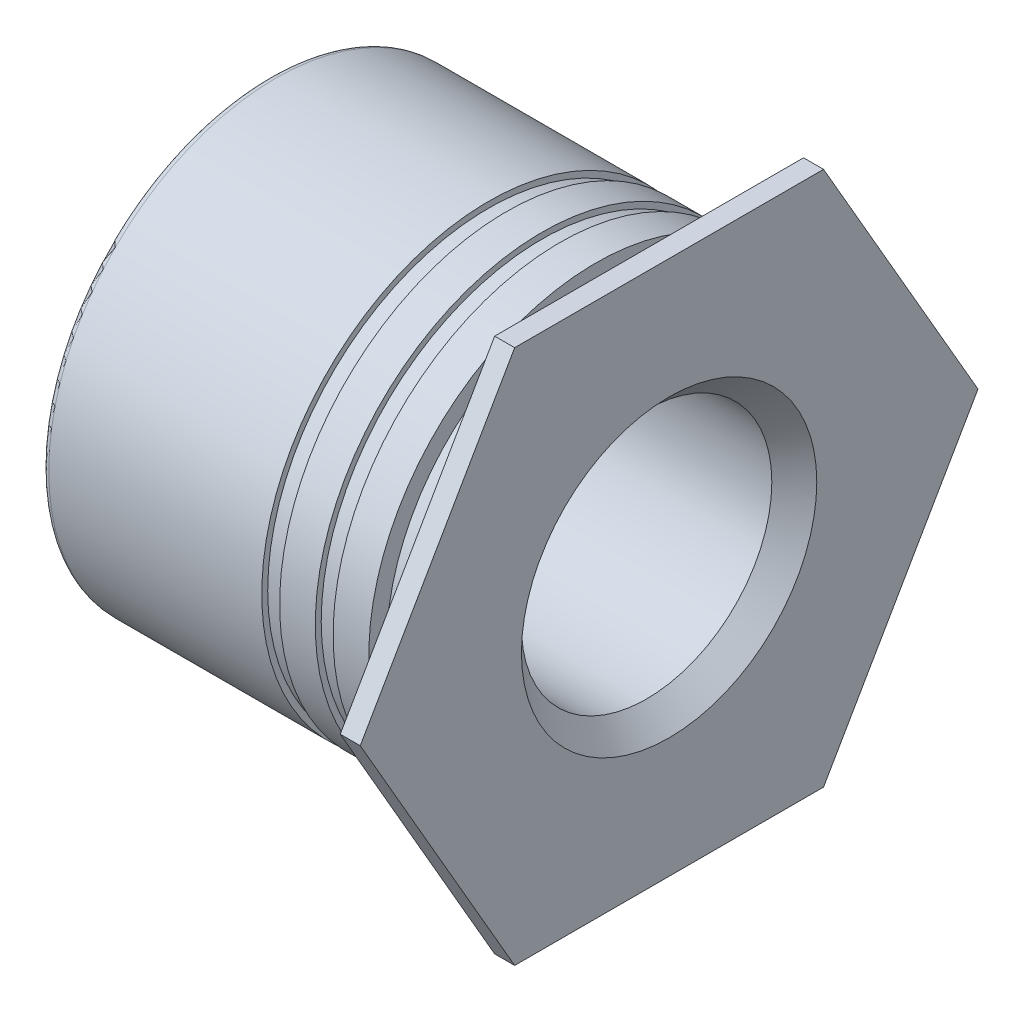
ISO-10303-21;
HEADER;
FILE_DESCRIPTION(('STEP AP214'),'2;1');
FILE_NAME('part.step','',(''),(''),'','','');
FILE_SCHEMA(('AUTOMOTIVE_DESIGN { 1 0 10303 214 1 1 1 1 }'));
ENDSEC;
DATA;
#1=APPLICATION_CONTEXT('core data for automotive mechanical design processes');
#2=APPLICATION_PROTOCOL_DEFINITION('international standard','automotive_design',2000,#1);
#3=PRODUCT_CONTEXT('',#1,'mechanical');
#4=PRODUCT('Part','Part','',(#3));
#5=PRODUCT_RELATED_PRODUCT_CATEGORY('part','',(#4));
#6=PRODUCT_DEFINITION_FORMATION('','',#4);
#7=PRODUCT_DEFINITION_CONTEXT('part definition',#1,'design');
#8=PRODUCT_DEFINITION('design','',#6,#7);
#9=PRODUCT_DEFINITION_SHAPE('','',#8);
#10=(LENGTH_UNIT() NAMED_UNIT(*) SI_UNIT(.MILLI.,.METRE.));
#11=(NAMED_UNIT(*) PLANE_ANGLE_UNIT() SI_UNIT($,.RADIAN.));
#12=(NAMED_UNIT(*) SI_UNIT($,.STERADIAN.) SOLID_ANGLE_UNIT());
#13=UNCERTAINTY_MEASURE_WITH_UNIT(LENGTH_MEASURE(1.E-05),#10,'distance_accuracy_value','');
#14=(GEOMETRIC_REPRESENTATION_CONTEXT(3) GLOBAL_UNCERTAINTY_ASSIGNED_CONTEXT((#13)) GLOBAL_UNIT_ASSIGNED_CONTEXT((#10,
#11,#12)) REPRESENTATION_CONTEXT('',''));
#15=CARTESIAN_POINT('',(0.,0.,0.));
#16=DIRECTION('',(0.,0.,1.));
#17=DIRECTION('',(1.,0.,0.));
#18=AXIS2_PLACEMENT_3D('',#15,#16,#17);
#19=CARTESIAN_POINT('',(-1.27,0.,0.));
#20=DIRECTION('',(1.,0.,0.));
#21=DIRECTION('',(0.,0.,-1.));
#22=AXIS2_PLACEMENT_3D('',#19,#20,#21);
#23=CYLINDRICAL_SURFACE('',#22,2.6218444444444);
#24=CARTESIAN_POINT('',(-1.27,0.,0.));
#25=DIRECTION('',(1.,0.,0.));
#26=DIRECTION('',(0.,0.,-1.));
#27=AXIS2_PLACEMENT_3D('',#24,#25,#26);
#28=CIRCLE('',#27,2.6218444444444);
#29=CARTESIAN_POINT('',(-1.27,0.,-2.6218444444444));
#30=VERTEX_POINT('',#29);
#31=EDGE_CURVE('E184',#30,#30,#28,.F.);
#32=ORIENTED_EDGE('',*,*,#31,.F.);
#33=EDGE_LOOP('',(#32));
#34=FACE_BOUND('',#33,.T.);
#35=CARTESIAN_POINT('',(-1.0583333333333,0.,0.));
#36=DIRECTION('',(1.,0.,0.));
#37=DIRECTION('',(0.,0.,-1.));
#38=AXIS2_PLACEMENT_3D('',#35,#36,#37);
#39=CIRCLE('',#38,2.6218444444444);
#40=CARTESIAN_POINT('',(-1.0583333333333,0.,-2.6218444444444));
#41=VERTEX_POINT('',#40);
#42=EDGE_CURVE('E21',#41,#41,#39,.T.);
#43=ORIENTED_EDGE('',*,*,#42,.F.);
#44=EDGE_LOOP('',(#43));
#45=FACE_BOUND('',#44,.T.);
#46=ADVANCED_FACE('F17',(#34,#45),#23,.T.);
#47=CARTESIAN_POINT('',(-1.0583333333333,-2.6924,-2.6924));
#48=DIRECTION('',(-1.,0.,0.));
#49=DIRECTION('',(0.,0.,1.));
#50=AXIS2_PLACEMENT_3D('',#47,#48,#49);
#51=PLANE('',#50);
#52=ORIENTED_EDGE('',*,*,#42,.T.);
#53=EDGE_LOOP('',(#52));
#54=FACE_BOUND('',#53,.T.);
#55=CARTESIAN_POINT('',(-1.0583333333333,0.,0.));
#56=DIRECTION('',(1.,0.,0.));
#57=DIRECTION('',(0.,0.,-1.));
#58=AXIS2_PLACEMENT_3D('',#55,#56,#57);
#59=CIRCLE('',#58,2.6924);
#60=CARTESIAN_POINT('',(-1.0583333333333,0.,-2.6924));
#61=VERTEX_POINT('',#60);
#62=EDGE_CURVE('E182',#61,#61,#59,.T.);
#63=ORIENTED_EDGE('',*,*,#62,.F.);
#64=EDGE_LOOP('',(#63));
#65=FACE_BOUND('',#64,.T.);
#66=ADVANCED_FACE('F191',(#54,#65),#51,.T.);
#67=CARTESIAN_POINT('',(-1.27,-2.6924,2.746248));
#68=DIRECTION('',(1.,0.,0.));
#69=DIRECTION('',(0.,0.,-1.));
#70=AXIS2_PLACEMENT_3D('',#67,#68,#69);
#71=PLANE('',#70);
#72=CARTESIAN_POINT('',(-1.27,0.,0.));
#73=DIRECTION('',(1.,0.,0.));
#74=DIRECTION('',(0.,0.,-1.));
#75=AXIS2_PLACEMENT_3D('',#72,#73,#74);
#76=CIRCLE('',#75,2.6924);
#77=CARTESIAN_POINT('',(-1.27,0.,-2.6924));
#78=VERTEX_POINT('',#77);
#79=EDGE_CURVE('E179',#78,#78,#76,.F.);
#80=ORIENTED_EDGE('',*,*,#79,.F.);
#81=EDGE_LOOP('',(#80));
#82=FACE_BOUND('',#81,.T.);
#83=ORIENTED_EDGE('',*,*,#31,.T.);
#84=EDGE_LOOP('',(#83));
#85=FACE_BOUND('',#84,.T.);
#86=ADVANCED_FACE('F202',(#82,#85),#71,.T.);
#87=CARTESIAN_POINT('',(-1.0583333333333,0.,0.));
#88=DIRECTION('',(1.,0.,0.));
#89=DIRECTION('',(0.,0.,-1.));
#90=AXIS2_PLACEMENT_3D('',#87,#88,#89);
#91=CYLINDRICAL_SURFACE('',#90,2.6924);
#92=CARTESIAN_POINT('',(-0.635,0.,0.));
#93=DIRECTION('',(1.,0.,0.));
#94=DIRECTION('',(0.,0.,-1.));
#95=AXIS2_PLACEMENT_3D('',#92,#93,#94);
#96=CIRCLE('',#95,2.6924);
#97=CARTESIAN_POINT('',(-0.635,0.,-2.6924));
#98=VERTEX_POINT('',#97);
#99=EDGE_CURVE('E176',#98,#98,#96,.T.);
#100=ORIENTED_EDGE('',*,*,#99,.F.);
#101=EDGE_LOOP('',(#100));
#102=FACE_BOUND('',#101,.T.);
#103=ORIENTED_EDGE('',*,*,#62,.T.);
#104=EDGE_LOOP('',(#103));
#105=FACE_BOUND('',#104,.T.);
#106=ADVANCED_FACE('F284',(#102,#105),#91,.T.);
#107=CARTESIAN_POINT('',(-1.6933333333333,0.,0.));
#108=DIRECTION('',(1.,0.,0.));
#109=DIRECTION('',(0.,0.,-1.));
#110=AXIS2_PLACEMENT_3D('',#107,#108,#109);
#111=CYLINDRICAL_SURFACE('',#110,2.6924);
#112=ORIENTED_EDGE('',*,*,#79,.T.);
#113=EDGE_LOOP('',(#112));
#114=FACE_BOUND('',#113,.T.);
#115=CARTESIAN_POINT('',(-1.6933333333333,0.,0.));
#116=DIRECTION('',(1.,0.,0.));
#117=DIRECTION('',(0.,0.,-1.));
#118=AXIS2_PLACEMENT_3D('',#115,#116,#117);
#119=CIRCLE('',#118,2.6924);
#120=CARTESIAN_POINT('',(-1.6933333333333,0.,-2.6924));
#121=VERTEX_POINT('',#120);
#122=EDGE_CURVE('E173',#121,#121,#119,.F.);
#123=ORIENTED_EDGE('',*,*,#122,.F.);
#124=EDGE_LOOP('',(#123));
#125=FACE_BOUND('',#124,.T.);
#126=ADVANCED_FACE('F280',(#114,#125),#111,.T.);
#127=CARTESIAN_POINT('',(-0.635,-2.6924,2.746248));
#128=DIRECTION('',(1.,0.,0.));
#129=DIRECTION('',(0.,0.,-1.));
#130=AXIS2_PLACEMENT_3D('',#127,#128,#129);
#131=PLANE('',#130);
#132=ORIENTED_EDGE('',*,*,#99,.T.);
#133=EDGE_LOOP('',(#132));
#134=FACE_BOUND('',#133,.T.);
#135=CARTESIAN_POINT('',(-0.635,0.,0.));
#136=DIRECTION('',(1.,0.,0.));
#137=DIRECTION('',(0.,0.,-1.));
#138=AXIS2_PLACEMENT_3D('',#135,#136,#137);
#139=CIRCLE('',#138,2.4807333333333);
#140=CARTESIAN_POINT('',(-0.635,0.,-2.4807333333333));
#141=VERTEX_POINT('',#140);
#142=EDGE_CURVE('E170',#141,#141,#139,.T.);
#143=ORIENTED_EDGE('',*,*,#142,.F.);
#144=EDGE_LOOP('',(#143));
#145=FACE_BOUND('',#144,.T.);
#146=ADVANCED_FACE('F276',(#134,#145),#131,.T.);
#147=CARTESIAN_POINT('',(-1.6933333333333,-2.6924,-2.6924));
#148=DIRECTION('',(-1.,0.,0.));
#149=DIRECTION('',(0.,0.,1.));
#150=AXIS2_PLACEMENT_3D('',#147,#148,#149);
#151=PLANE('',#150);
#152=CARTESIAN_POINT('',(-1.6933333333333,0.,0.));
#153=DIRECTION('',(1.,0.,0.));
#154=DIRECTION('',(0.,0.,-1.));
#155=AXIS2_PLACEMENT_3D('',#152,#153,#154);
#156=CIRCLE('',#155,2.6218444444444);
#157=CARTESIAN_POINT('',(-1.6933333333333,0.,-2.6218444444444));
#158=VERTEX_POINT('',#157);
#159=EDGE_CURVE('E167',#158,#158,#156,.F.);
#160=ORIENTED_EDGE('',*,*,#159,.F.);
#161=EDGE_LOOP('',(#160));
#162=FACE_BOUND('',#161,.T.);
#163=ORIENTED_EDGE('',*,*,#122,.T.);
#164=EDGE_LOOP('',(#163));
#165=FACE_BOUND('',#164,.T.);
#166=ADVANCED_FACE('F272',(#162,#165),#151,.T.);
#167=CARTESIAN_POINT('',(-0.635,0.,0.));
#168=DIRECTION('',(1.,0.,0.));
#169=DIRECTION('',(0.,0.,-1.));
#170=AXIS2_PLACEMENT_3D('',#167,#168,#169);
#171=CYLINDRICAL_SURFACE('',#170,2.4807333333333);
#172=ORIENTED_EDGE('',*,*,#142,.T.);
#173=EDGE_LOOP('',(#172));
#174=FACE_BOUND('',#173,.T.);
#175=CARTESIAN_POINT('',(0.,0.,0.));
#176=DIRECTION('',(1.,0.,0.));
#177=DIRECTION('',(0.,0.,-1.));
#178=AXIS2_PLACEMENT_3D('',#175,#176,#177);
#179=CIRCLE('',#178,2.4807333333333);
#180=CARTESIAN_POINT('',(0.,0.,-2.4807333333333));
#181=VERTEX_POINT('',#180);
#182=EDGE_CURVE('E164',#181,#181,#179,.T.);
#183=ORIENTED_EDGE('',*,*,#182,.F.);
#184=EDGE_LOOP('',(#183));
#185=FACE_BOUND('',#184,.T.);
#186=ADVANCED_FACE('F268',(#174,#185),#171,.T.);
#187=CARTESIAN_POINT('',(-1.905,0.,0.));
#188=DIRECTION('',(1.,0.,0.));
#189=DIRECTION('',(0.,0.,-1.));
#190=AXIS2_PLACEMENT_3D('',#187,#188,#189);
#191=CYLINDRICAL_SURFACE('',#190,2.6218444444444);
#192=CARTESIAN_POINT('',(-1.905,0.,0.));
#193=DIRECTION('',(1.,0.,0.));
#194=DIRECTION('',(0.,0.,-1.));
#195=AXIS2_PLACEMENT_3D('',#192,#193,#194);
#196=CIRCLE('',#195,2.6218444444444);
#197=CARTESIAN_POINT('',(-1.905,0.,-2.6218444444444));
#198=VERTEX_POINT('',#197);
#199=EDGE_CURVE('E91',#198,#198,#196,.F.);
#200=ORIENTED_EDGE('',*,*,#199,.F.);
#201=EDGE_LOOP('',(#200));
#202=FACE_BOUND('',#201,.T.);
#203=ORIENTED_EDGE('',*,*,#159,.T.);
#204=EDGE_LOOP('',(#203));
#205=FACE_BOUND('',#204,.T.);
#206=ADVANCED_FACE('F265',(#202,#205),#191,.T.);
#207=CARTESIAN_POINT('',(0.,3.175,-3.6661742093541));
#208=DIRECTION('',(-1.,0.,0.));
#209=DIRECTION('',(0.,-1.,0.));
#210=AXIS2_PLACEMENT_3D('',#207,#208,#209);
#211=PLANE('',#210);
#212=DIRECTION('',(0.,-0.866025403784446,0.499999999999987));
#213=VECTOR('',#212,1.);
#214=CARTESIAN_POINT('',(0.,1.5875,2.7496306570156));
#215=LINE('',#214,#213);
#216=CARTESIAN_POINT('',(0.,3.175,1.8330871046771));
#217=VERTEX_POINT('',#216);
#218=CARTESIAN_POINT('',(0.,-2.50000324261701E-10,3.66617420920976));
#219=VERTEX_POINT('',#218);
#220=EDGE_CURVE('E82',#217,#219,#215,.T.);
#221=ORIENTED_EDGE('',*,*,#220,.F.);
#222=DIRECTION('',(0.,0.,1.));
#223=VECTOR('',#222,1.);
#224=CARTESIAN_POINT('',(0.,3.175,0.));
#225=LINE('',#224,#223);
#226=CARTESIAN_POINT('',(0.,3.175,-1.8330871046771));
#227=VERTEX_POINT('',#226);
#228=EDGE_CURVE('E78',#227,#217,#225,.T.);
#229=ORIENTED_EDGE('',*,*,#228,.F.);
#230=DIRECTION('',(0.,0.866025403784446,0.499999999999988));
#231=VECTOR('',#230,1.);
#232=CARTESIAN_POINT('',(0.,1.5875,-2.7496306570156));
#233=LINE('',#232,#231);
#234=CARTESIAN_POINT('',(0.,1.25003153993385E-10,-3.66617420928193));
#235=VERTEX_POINT('',#234);
#236=EDGE_CURVE('E63',#235,#227,#233,.T.);
#237=ORIENTED_EDGE('',*,*,#236,.F.);
#238=DIRECTION('',(0.,0.866025403784446,-0.499999999999987));
#239=VECTOR('',#238,1.);
#240=CARTESIAN_POINT('',(0.,-1.5875,-2.7496306570156));
#241=LINE('',#240,#239);
#242=CARTESIAN_POINT('',(0.,-3.175,-1.8330871046771));
#243=VERTEX_POINT('',#242);
#244=EDGE_CURVE('E67',#243,#235,#241,.T.);
#245=ORIENTED_EDGE('',*,*,#244,.F.);
#246=DIRECTION('',(0.,0.,-1.));
#247=VECTOR('',#246,1.);
#248=CARTESIAN_POINT('',(0.,-3.175,0.));
#249=LINE('',#248,#247);
#250=CARTESIAN_POINT('',(0.,-3.175,1.8330871046771));
#251=VERTEX_POINT('',#250);
#252=EDGE_CURVE('E123',#251,#243,#249,.T.);
#253=ORIENTED_EDGE('',*,*,#252,.F.);
#254=DIRECTION('',(0.,-0.866025403784446,-0.499999999999987));
#255=VECTOR('',#254,1.);
#256=CARTESIAN_POINT('',(0.,-1.5875,2.7496306570156));
#257=LINE('',#256,#255);
#258=EDGE_CURVE('E114',#219,#251,#257,.T.);
#259=ORIENTED_EDGE('',*,*,#258,.F.);
#260=EDGE_LOOP('',(#221,#229,#237,#245,#253,#259));
#261=FACE_BOUND('',#260,.T.);
#262=ORIENTED_EDGE('',*,*,#182,.T.);
#263=EDGE_LOOP('',(#262));
#264=FACE_BOUND('',#263,.T.);
#265=ADVANCED_FACE('F79',(#261,#264),#211,.T.);
#266=CARTESIAN_POINT('',(-1.905,-2.6924,2.746248));
#267=DIRECTION('',(1.,0.,0.));
#268=DIRECTION('',(0.,0.,-1.));
#269=AXIS2_PLACEMENT_3D('',#266,#267,#268);
#270=PLANE('',#269);
#271=CARTESIAN_POINT('',(-1.905,0.,0.));
#272=DIRECTION('',(1.,0.,0.));
#273=DIRECTION('',(0.,0.,-1.));
#274=AXIS2_PLACEMENT_3D('',#271,#272,#273);
#275=CIRCLE('',#274,2.6924);
#276=CARTESIAN_POINT('',(-1.905,0.,-2.6924));
#277=VERTEX_POINT('',#276);
#278=EDGE_CURVE('E159',#277,#277,#275,.F.);
#279=ORIENTED_EDGE('',*,*,#278,.F.);
#280=EDGE_LOOP('',(#279));
#281=FACE_BOUND('',#280,.T.);
#282=ORIENTED_EDGE('',*,*,#199,.T.);
#283=EDGE_LOOP('',(#282));
#284=FACE_BOUND('',#283,.T.);
#285=ADVANCED_FACE('F259',(#281,#284),#270,.T.);
#286=CARTESIAN_POINT('',(0.23749,0.,-3.6661742093541));
#287=DIRECTION('',(0.,0.499999999999988,-0.866025403784446));
#288=DIRECTION('',(-1.,0.,0.));
#289=AXIS2_PLACEMENT_3D('',#286,#287,#288);
#290=PLANE('',#289);
#291=CARTESIAN_POINT('',(0.23749,0.,-3.6661742093541));
#292=CARTESIAN_POINT('',(0.,0.,-3.6661742093541));
#293=B_SPLINE_CURVE_WITH_KNOTS('',1,(#291,#292),.UNSPECIFIED.,.F.,.F.,(2,2),(0.,0.23749),.UNSPECIFIED.);
#294=CARTESIAN_POINT('',(0.23749,0.,-3.6661742093541));
#295=VERTEX_POINT('',#294);
#296=EDGE_CURVE('E90',#235,#295,#293,.F.);
#297=ORIENTED_EDGE('',*,*,#296,.F.);
#298=ORIENTED_EDGE('',*,*,#236,.T.);
#299=CARTESIAN_POINT('',(0.23749,3.175,-1.8330871046771));
#300=CARTESIAN_POINT('',(0.,3.175,-1.8330871046771));
#301=B_SPLINE_CURVE_WITH_KNOTS('',1,(#299,#300),.UNSPECIFIED.,.F.,.F.,(2,2),(0.,0.23749),.UNSPECIFIED.);
#302=CARTESIAN_POINT('',(0.23749,3.175,-1.8330871046771));
#303=VERTEX_POINT('',#302);
#304=EDGE_CURVE('E86',#303,#227,#301,.T.);
#305=ORIENTED_EDGE('',*,*,#304,.F.);
#306=DIRECTION('',(0.,0.866025403784446,0.499999999999988));
#307=VECTOR('',#306,1.);
#308=CARTESIAN_POINT('',(0.23749,0.,-3.6661742093541));
#309=LINE('',#308,#307);
#310=EDGE_CURVE('E55',#295,#303,#309,.T.);
#311=ORIENTED_EDGE('',*,*,#310,.F.);
#312=EDGE_LOOP('',(#297,#298,#305,#311));
#313=FACE_BOUND('',#312,.T.);
#314=ADVANCED_FACE('F88',(#313),#290,.T.);
#315=CARTESIAN_POINT('',(0.23749,3.175,-1.8330871046771));
#316=DIRECTION('',(0.,1.,0.));
#317=DIRECTION('',(-1.,0.,0.));
#318=AXIS2_PLACEMENT_3D('',#315,#316,#317);
#319=PLANE('',#318);
#320=ORIENTED_EDGE('',*,*,#304,.T.);
#321=ORIENTED_EDGE('',*,*,#228,.T.);
#322=CARTESIAN_POINT('',(0.23749,3.175,1.8330871046771));
#323=CARTESIAN_POINT('',(0.,3.175,1.8330871046771));
#324=B_SPLINE_CURVE_WITH_KNOTS('',1,(#322,#323),.UNSPECIFIED.,.F.,.F.,(2,2),(0.,0.23749),.UNSPECIFIED.);
#325=CARTESIAN_POINT('',(0.23749,3.175,1.8330871046771));
#326=VERTEX_POINT('',#325);
#327=EDGE_CURVE('E97',#326,#217,#324,.T.);
#328=ORIENTED_EDGE('',*,*,#327,.F.);
#329=DIRECTION('',(0.,0.,1.));
#330=VECTOR('',#329,1.);
#331=CARTESIAN_POINT('',(0.23749,3.175,0.));
#332=LINE('',#331,#330);
#333=EDGE_CURVE('E95',#303,#326,#332,.T.);
#334=ORIENTED_EDGE('',*,*,#333,.F.);
#335=EDGE_LOOP('',(#320,#321,#328,#334));
#336=FACE_BOUND('',#335,.T.);
#337=ADVANCED_FACE('F93',(#336),#319,.T.);
#338=CARTESIAN_POINT('',(0.23749,3.175,1.8330871046771));
#339=DIRECTION('',(0.,0.499999999999987,0.866025403784446));
#340=DIRECTION('',(-1.,0.,0.));
#341=AXIS2_PLACEMENT_3D('',#338,#339,#340);
#342=PLANE('',#341);
#343=ORIENTED_EDGE('',*,*,#327,.T.);
#344=ORIENTED_EDGE('',*,*,#220,.T.);
#345=CARTESIAN_POINT('',(0.23749,0.,3.6661742093541));
#346=CARTESIAN_POINT('',(0.,0.,3.6661742093541));
#347=B_SPLINE_CURVE_WITH_KNOTS('',1,(#345,#346),.UNSPECIFIED.,.F.,.F.,(2,2),(0.,0.23749),.UNSPECIFIED.);
#348=CARTESIAN_POINT('',(0.23749,0.,3.6661742093541));
#349=VERTEX_POINT('',#348);
#350=EDGE_CURVE('E115',#349,#219,#347,.T.);
#351=ORIENTED_EDGE('',*,*,#350,.F.);
#352=DIRECTION('',(0.,-0.866025403784446,0.499999999999987));
#353=VECTOR('',#352,1.);
#354=CARTESIAN_POINT('',(0.23749,3.175,1.8330871046771));
#355=LINE('',#354,#353);
#356=EDGE_CURVE('E110',#326,#349,#355,.T.);
#357=ORIENTED_EDGE('',*,*,#356,.F.);
#358=EDGE_LOOP('',(#343,#344,#351,#357));
#359=FACE_BOUND('',#358,.T.);
#360=ADVANCED_FACE('F250',(#359),#342,.T.);
#361=CARTESIAN_POINT('',(0.23749,0.,3.6661742093541));
#362=DIRECTION('',(0.,-0.499999999999987,0.866025403784446));
#363=DIRECTION('',(-1.,0.,0.));
#364=AXIS2_PLACEMENT_3D('',#361,#362,#363);
#365=PLANE('',#364);
#366=ORIENTED_EDGE('',*,*,#350,.T.);
#367=ORIENTED_EDGE('',*,*,#258,.T.);
#368=CARTESIAN_POINT('',(0.23749,-3.175,1.8330871046771));
#369=CARTESIAN_POINT('',(0.,-3.175,1.8330871046771));
#370=B_SPLINE_CURVE_WITH_KNOTS('',1,(#368,#369),.UNSPECIFIED.,.F.,.F.,(2,2),(0.,0.23749),.UNSPECIFIED.);
#371=CARTESIAN_POINT('',(0.23749,-3.175,1.8330871046771));
#372=VERTEX_POINT('',#371);
#373=EDGE_CURVE('E124',#372,#251,#370,.T.);
#374=ORIENTED_EDGE('',*,*,#373,.F.);
#375=DIRECTION('',(0.,-0.866025403784446,-0.499999999999987));
#376=VECTOR('',#375,1.);
#377=CARTESIAN_POINT('',(0.23749,0.,3.6661742093541));
#378=LINE('',#377,#376);
#379=EDGE_CURVE('E153',#349,#372,#378,.T.);
#380=ORIENTED_EDGE('',*,*,#379,.F.);
#381=EDGE_LOOP('',(#366,#367,#374,#380));
#382=FACE_BOUND('',#381,.T.);
#383=ADVANCED_FACE('F247',(#382),#365,.T.);
#384=CARTESIAN_POINT('',(0.23749,-3.175,1.8330871046771));
#385=DIRECTION('',(0.,-1.,0.));
#386=DIRECTION('',(-1.,0.,0.));
#387=AXIS2_PLACEMENT_3D('',#384,#385,#386);
#388=PLANE('',#387);
#389=ORIENTED_EDGE('',*,*,#373,.T.);
#390=ORIENTED_EDGE('',*,*,#252,.T.);
#391=CARTESIAN_POINT('',(0.23749,-3.175,-1.8330871046771));
#392=CARTESIAN_POINT('',(0.,-3.175,-1.8330871046771));
#393=B_SPLINE_CURVE_WITH_KNOTS('',1,(#391,#392),.UNSPECIFIED.,.F.,.F.,(2,2),(0.,0.23749),.UNSPECIFIED.);
#394=CARTESIAN_POINT('',(0.23749,-3.175,-1.8330871046771));
#395=VERTEX_POINT('',#394);
#396=EDGE_CURVE('E36',#395,#243,#393,.T.);
#397=ORIENTED_EDGE('',*,*,#396,.F.);
#398=DIRECTION('',(0.,0.,-1.));
#399=VECTOR('',#398,1.);
#400=CARTESIAN_POINT('',(0.23749,-3.175,0.));
#401=LINE('',#400,#399);
#402=EDGE_CURVE('E152',#372,#395,#401,.T.);
#403=ORIENTED_EDGE('',*,*,#402,.F.);
#404=EDGE_LOOP('',(#389,#390,#397,#403));
#405=FACE_BOUND('',#404,.T.);
#406=ADVANCED_FACE('F243',(#405),#388,.T.);
#407=CARTESIAN_POINT('',(0.23749,-3.175,-1.8330871046771));
#408=DIRECTION('',(0.,-0.499999999999987,-0.866025403784446));
#409=DIRECTION('',(-1.,0.,0.));
#410=AXIS2_PLACEMENT_3D('',#407,#408,#409);
#411=PLANE('',#410);
#412=ORIENTED_EDGE('',*,*,#396,.T.);
#413=ORIENTED_EDGE('',*,*,#244,.T.);
#414=ORIENTED_EDGE('',*,*,#296,.T.);
#415=DIRECTION('',(0.,0.866025403784446,-0.499999999999987));
#416=VECTOR('',#415,1.);
#417=CARTESIAN_POINT('',(0.23749,-3.175,-1.8330871046771));
#418=LINE('',#417,#416);
#419=EDGE_CURVE('E149',#395,#295,#418,.T.);
#420=ORIENTED_EDGE('',*,*,#419,.F.);
#421=EDGE_LOOP('',(#412,#413,#414,#420));
#422=FACE_BOUND('',#421,.T.);
#423=ADVANCED_FACE('F239',(#422),#411,.T.);
#424=CARTESIAN_POINT('',(-4.4331466666667,0.,0.));
#425=DIRECTION('',(1.,0.,0.));
#426=DIRECTION('',(0.,0.,-1.));
#427=AXIS2_PLACEMENT_3D('',#424,#425,#426);
#428=CYLINDRICAL_SURFACE('',#427,2.6924);
#429=CARTESIAN_POINT('',(-4.4331466666667,0.,0.));
#430=DIRECTION('',(-1.,0.,0.));
#431=DIRECTION('',(0.,0.,1.));
#432=AXIS2_PLACEMENT_3D('',#429,#430,#431);
#433=CIRCLE('',#432,2.6924);
#434=CARTESIAN_POINT('',(-4.4331466666667,0.,2.6924));
#435=VERTEX_POINT('',#434);
#436=EDGE_CURVE('E148',#435,#435,#433,.T.);
#437=ORIENTED_EDGE('',*,*,#436,.F.);
#438=EDGE_LOOP('',(#437));
#439=FACE_BOUND('',#438,.T.);
#440=ORIENTED_EDGE('',*,*,#278,.T.);
#441=EDGE_LOOP('',(#440));
#442=FACE_BOUND('',#441,.T.);
#443=ADVANCED_FACE('F235',(#439,#442),#428,.T.);
#444=CARTESIAN_POINT('',(0.23749,-3.175,-3.6661742093541));
#445=DIRECTION('',(1.,0.,0.));
#446=DIRECTION('',(0.,1.,0.));
#447=AXIS2_PLACEMENT_3D('',#444,#445,#446);
#448=PLANE('',#447);
#449=ORIENTED_EDGE('',*,*,#402,.T.);
#450=ORIENTED_EDGE('',*,*,#419,.T.);
#451=ORIENTED_EDGE('',*,*,#310,.T.);
#452=ORIENTED_EDGE('',*,*,#333,.T.);
#453=ORIENTED_EDGE('',*,*,#356,.T.);
#454=ORIENTED_EDGE('',*,*,#379,.T.);
#455=EDGE_LOOP('',(#449,#450,#451,#452,#453,#454));
#456=FACE_BOUND('',#455,.T.);
#457=CARTESIAN_POINT('',(0.23749,0.,0.));
#458=DIRECTION('',(1.,0.,0.));
#459=DIRECTION('',(0.,0.,-1.));
#460=AXIS2_PLACEMENT_3D('',#457,#458,#459);
#461=CIRCLE('',#460,1.7526);
#462=CARTESIAN_POINT('',(0.23749,0.,-1.7526));
#463=VERTEX_POINT('',#462);
#464=EDGE_CURVE('E145',#463,#463,#461,.T.);
#465=ORIENTED_EDGE('',*,*,#464,.F.);
#466=EDGE_LOOP('',(#465));
#467=FACE_BOUND('',#466,.T.);
#468=ADVANCED_FACE('F231',(#456,#467),#448,.T.);
#469=CARTESIAN_POINT('',(-4.4331466666667,0.,0.));
#470=DIRECTION('',(1.,0.,0.));
#471=DIRECTION('',(0.,0.,-1.));
#472=AXIS2_PLACEMENT_3D('',#469,#470,#471);
#473=TOROIDAL_SURFACE('',#472,2.6132366666667,0.0791633333332992);
#474=CARTESIAN_POINT('',(-4.51231,0.,0.));
#475=DIRECTION('',(1.,0.,0.));
#476=DIRECTION('',(0.,0.,-1.));
#477=AXIS2_PLACEMENT_3D('',#474,#475,#476);
#478=CIRCLE('',#477,2.6132366666667);
#479=CARTESIAN_POINT('',(-4.51231,0.,-2.6132366666667));
#480=VERTEX_POINT('',#479);
#481=EDGE_CURVE('E142',#480,#480,#478,.F.);
#482=ORIENTED_EDGE('',*,*,#481,.F.);
#483=EDGE_LOOP('',(#482));
#484=FACE_BOUND('',#483,.T.);
#485=ORIENTED_EDGE('',*,*,#436,.T.);
#486=EDGE_LOOP('',(#485));
#487=FACE_BOUND('',#486,.T.);
#488=ADVANCED_FACE('F225',(#484,#487),#473,.T.);
#489=CARTESIAN_POINT('',(-0.02921,0.,0.));
#490=DIRECTION('',(1.,0.,0.));
#491=DIRECTION('',(0.,0.,-1.));
#492=AXIS2_PLACEMENT_3D('',#489,#490,#491);
#493=CONICAL_SURFACE('',#492,1.4859,0.785398163397449);
#494=ORIENTED_EDGE('',*,*,#464,.T.);
#495=EDGE_LOOP('',(#494));
#496=FACE_BOUND('',#495,.T.);
#497=CARTESIAN_POINT('',(-0.02921,0.,0.));
#498=DIRECTION('',(1.,0.,0.));
#499=DIRECTION('',(0.,0.,-1.));
#500=AXIS2_PLACEMENT_3D('',#497,#498,#499);
#501=CIRCLE('',#500,1.4859);
#502=CARTESIAN_POINT('',(-0.02921,0.,-1.4859));
#503=VERTEX_POINT('',#502);
#504=EDGE_CURVE('E141',#503,#503,#501,.T.);
#505=ORIENTED_EDGE('',*,*,#504,.F.);
#506=EDGE_LOOP('',(#505));
#507=FACE_BOUND('',#506,.T.);
#508=ADVANCED_FACE('F218',(#496,#507),#493,.F.);
#509=CARTESIAN_POINT('',(-4.51231,2.6132366666667,-2.66550140000003));
#510=DIRECTION('',(-1.,0.,0.));
#511=DIRECTION('',(0.,-1.,0.));
#512=AXIS2_PLACEMENT_3D('',#509,#510,#511);
#513=PLANE('',#512);
#514=ORIENTED_EDGE('',*,*,#481,.T.);
#515=EDGE_LOOP('',(#514));
#516=FACE_BOUND('',#515,.T.);
#517=CARTESIAN_POINT('',(-4.51231,0.,0.));
#518=DIRECTION('',(-1.,0.,0.));
#519=DIRECTION('',(0.,0.,1.));
#520=AXIS2_PLACEMENT_3D('',#517,#518,#519);
#521=CIRCLE('',#520,1.7526);
#522=CARTESIAN_POINT('',(-4.51231,0.,1.7526));
#523=VERTEX_POINT('',#522);
#524=EDGE_CURVE('E27',#523,#523,#521,.T.);
#525=ORIENTED_EDGE('',*,*,#524,.F.);
#526=EDGE_LOOP('',(#525));
#527=FACE_BOUND('',#526,.T.);
#528=ADVANCED_FACE('F211',(#516,#527),#513,.T.);
#529=CARTESIAN_POINT('',(-4.24561,0.,0.));
#530=DIRECTION('',(1.,0.,0.));
#531=DIRECTION('',(0.,0.,-1.));
#532=AXIS2_PLACEMENT_3D('',#529,#530,#531);
#533=CYLINDRICAL_SURFACE('',#532,1.4859);
#534=CARTESIAN_POINT('',(-4.24561,0.,0.));
#535=DIRECTION('',(1.,0.,0.));
#536=DIRECTION('',(0.,0.,-1.));
#537=AXIS2_PLACEMENT_3D('',#534,#535,#536);
#538=CIRCLE('',#537,1.4859);
#539=CARTESIAN_POINT('',(-4.24561,0.,-1.4859));
#540=VERTEX_POINT('',#539);
#541=EDGE_CURVE('E11',#540,#540,#538,.T.);
#542=ORIENTED_EDGE('',*,*,#541,.F.);
#543=EDGE_LOOP('',(#542));
#544=FACE_BOUND('',#543,.T.);
#545=ORIENTED_EDGE('',*,*,#504,.T.);
#546=EDGE_LOOP('',(#545));
#547=FACE_BOUND('',#546,.T.);
#548=ADVANCED_FACE('F205',(#544,#547),#533,.F.);
#549=CARTESIAN_POINT('',(-4.51231,0.,0.));
#550=DIRECTION('',(-1.,0.,0.));
#551=DIRECTION('',(0.,0.,1.));
#552=AXIS2_PLACEMENT_3D('',#549,#550,#551);
#553=CONICAL_SURFACE('',#552,1.7526,0.785398163397451);
#554=ORIENTED_EDGE('',*,*,#541,.T.);
#555=EDGE_LOOP('',(#554));
#556=FACE_BOUND('',#555,.T.);
#557=ORIENTED_EDGE('',*,*,#524,.T.);
#558=EDGE_LOOP('',(#557));
#559=FACE_BOUND('',#558,.T.);
#560=ADVANCED_FACE('F19',(#556,#559),#553,.F.);
#561=CLOSED_SHELL('',(#46,#66,#86,#106,#126,#146,#166,#186,#206,#265,#285,#314,#337,#360,#383,
#406,#423,#443,#468,#488,#508,#528,#548,#560));
#562=MANIFOLD_SOLID_BREP('B1',#561);
#563=ADVANCED_BREP_SHAPE_REPRESENTATION('',(#18,#562),#14);
#564=SHAPE_DEFINITION_REPRESENTATION(#9,#563);
ENDSEC;
END-ISO-10303-21;
